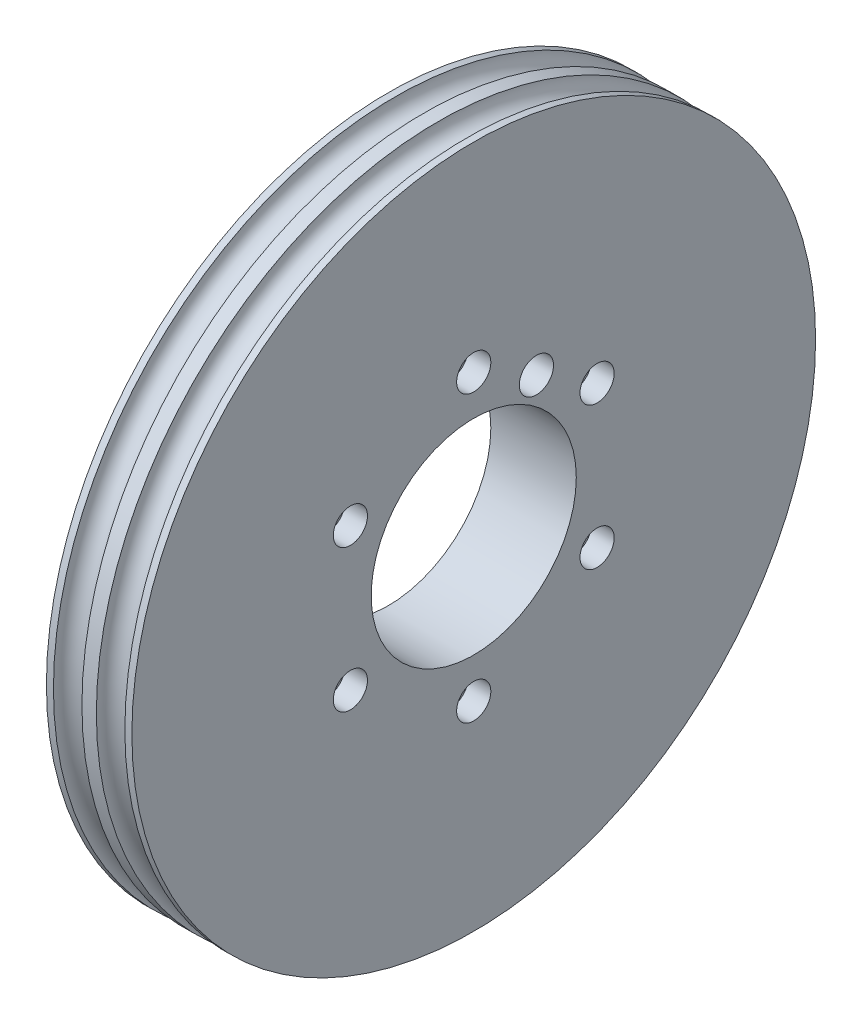
ISO-10303-21;
HEADER;
FILE_DESCRIPTION(('STEP AP214'),'2;1');
FILE_NAME('part.step','',(''),(''),'','','');
FILE_SCHEMA(('AUTOMOTIVE_DESIGN { 1 0 10303 214 1 1 1 1 }'));
ENDSEC;
DATA;
#1=APPLICATION_CONTEXT('core data for automotive mechanical design processes');
#2=APPLICATION_PROTOCOL_DEFINITION('international standard','automotive_design',2000,#1);
#3=PRODUCT_CONTEXT('',#1,'mechanical');
#4=PRODUCT('Part','Part','',(#3));
#5=PRODUCT_RELATED_PRODUCT_CATEGORY('part','',(#4));
#6=PRODUCT_DEFINITION_FORMATION('','',#4);
#7=PRODUCT_DEFINITION_CONTEXT('part definition',#1,'design');
#8=PRODUCT_DEFINITION('design','',#6,#7);
#9=PRODUCT_DEFINITION_SHAPE('','',#8);
#10=(LENGTH_UNIT() NAMED_UNIT(*) SI_UNIT(.MILLI.,.METRE.));
#11=(NAMED_UNIT(*) PLANE_ANGLE_UNIT() SI_UNIT($,.RADIAN.));
#12=(NAMED_UNIT(*) SI_UNIT($,.STERADIAN.) SOLID_ANGLE_UNIT());
#13=UNCERTAINTY_MEASURE_WITH_UNIT(LENGTH_MEASURE(1.E-05),#10,'distance_accuracy_value','');
#14=(GEOMETRIC_REPRESENTATION_CONTEXT(3) GLOBAL_UNCERTAINTY_ASSIGNED_CONTEXT((#13)) GLOBAL_UNIT_ASSIGNED_CONTEXT((#10,
#11,#12)) REPRESENTATION_CONTEXT('',''));
#15=CARTESIAN_POINT('',(0.,0.,0.));
#16=DIRECTION('',(0.,0.,1.));
#17=DIRECTION('',(1.,0.,0.));
#18=AXIS2_PLACEMENT_3D('',#15,#16,#17);
#19=CARTESIAN_POINT('',(-7.501,12.5000000000008,-21.6506350946114));
#20=DIRECTION('',(1.,0.,0.));
#21=DIRECTION('',(0.,0.,-1.));
#22=AXIS2_PLACEMENT_3D('',#19,#20,#21);
#23=CYLINDRICAL_SURFACE('',#22,2.0000000000011);
#24=CARTESIAN_POINT('',(-7.5,12.5000000000008,-21.6506350946114));
#25=DIRECTION('',(1.,0.,0.));
#26=DIRECTION('',(0.,0.,-1.));
#27=AXIS2_PLACEMENT_3D('',#24,#25,#26);
#28=CIRCLE('',#27,2.0000000000011);
#29=CARTESIAN_POINT('',(-7.5,12.5000000000008,-23.6506350946125));
#30=VERTEX_POINT('',#29);
#31=EDGE_CURVE('E160',#30,#30,#28,.F.);
#32=ORIENTED_EDGE('',*,*,#31,.T.);
#33=EDGE_LOOP('',(#32));
#34=FACE_BOUND('',#33,.T.);
#35=CARTESIAN_POINT('',(3.5,12.5000000000008,-21.6506350946114));
#36=DIRECTION('',(1.,0.,0.));
#37=DIRECTION('',(0.,0.,-1.));
#38=AXIS2_PLACEMENT_3D('',#35,#36,#37);
#39=CIRCLE('',#38,2.0000000000011);
#40=CARTESIAN_POINT('',(3.5,12.5000000000008,-23.6506350946125));
#41=VERTEX_POINT('',#40);
#42=EDGE_CURVE('E38',#41,#41,#39,.F.);
#43=ORIENTED_EDGE('',*,*,#42,.F.);
#44=EDGE_LOOP('',(#43));
#45=FACE_BOUND('',#44,.T.);
#46=ADVANCED_FACE('F34',(#34,#45),#23,.F.);
#47=CARTESIAN_POINT('',(-7.501,-12.4999999999992,-21.6506350946123));
#48=DIRECTION('',(1.,0.,0.));
#49=DIRECTION('',(0.,0.,-1.));
#50=AXIS2_PLACEMENT_3D('',#47,#48,#49);
#51=CYLINDRICAL_SURFACE('',#50,2.0000000000011);
#52=CARTESIAN_POINT('',(-7.5,-12.4999999999992,-21.6506350946123));
#53=DIRECTION('',(1.,0.,0.));
#54=DIRECTION('',(0.,0.,-1.));
#55=AXIS2_PLACEMENT_3D('',#52,#53,#54);
#56=CIRCLE('',#55,2.0000000000011);
#57=CARTESIAN_POINT('',(-7.5,-12.4999999999992,-23.6506350946134));
#58=VERTEX_POINT('',#57);
#59=EDGE_CURVE('E164',#58,#58,#56,.F.);
#60=ORIENTED_EDGE('',*,*,#59,.T.);
#61=EDGE_LOOP('',(#60));
#62=FACE_BOUND('',#61,.T.);
#63=CARTESIAN_POINT('',(3.5,-12.4999999999992,-21.6506350946123));
#64=DIRECTION('',(1.,0.,0.));
#65=DIRECTION('',(0.,0.,-1.));
#66=AXIS2_PLACEMENT_3D('',#63,#64,#65);
#67=CIRCLE('',#66,2.0000000000011);
#68=CARTESIAN_POINT('',(3.5,-12.4999999999992,-23.6506350946134));
#69=VERTEX_POINT('',#68);
#70=EDGE_CURVE('E89',#69,#69,#67,.F.);
#71=ORIENTED_EDGE('',*,*,#70,.F.);
#72=EDGE_LOOP('',(#71));
#73=FACE_BOUND('',#72,.T.);
#74=ADVANCED_FACE('F103',(#62,#73),#51,.F.);
#75=CARTESIAN_POINT('',(-7.501,-25.,-1.78591403627869E-12));
#76=DIRECTION('',(1.,0.,0.));
#77=DIRECTION('',(0.,0.,-1.));
#78=AXIS2_PLACEMENT_3D('',#75,#76,#77);
#79=CYLINDRICAL_SURFACE('',#78,2.00000000000109);
#80=CARTESIAN_POINT('',(-7.5,-25.,-1.78591403627869E-12));
#81=DIRECTION('',(1.,0.,0.));
#82=DIRECTION('',(0.,0.,-1.));
#83=AXIS2_PLACEMENT_3D('',#80,#81,#82);
#84=CIRCLE('',#83,2.00000000000109);
#85=CARTESIAN_POINT('',(-7.5,-25.,-2.00000000000288));
#86=VERTEX_POINT('',#85);
#87=EDGE_CURVE('E168',#86,#86,#84,.F.);
#88=ORIENTED_EDGE('',*,*,#87,.T.);
#89=EDGE_LOOP('',(#88));
#90=FACE_BOUND('',#89,.T.);
#91=CARTESIAN_POINT('',(3.5,-25.,-1.78591403627869E-12));
#92=DIRECTION('',(1.,0.,0.));
#93=DIRECTION('',(0.,0.,-1.));
#94=AXIS2_PLACEMENT_3D('',#91,#92,#93);
#95=CIRCLE('',#94,2.00000000000109);
#96=CARTESIAN_POINT('',(3.5,-25.,-2.00000000000288));
#97=VERTEX_POINT('',#96);
#98=EDGE_CURVE('E86',#97,#97,#95,.F.);
#99=ORIENTED_EDGE('',*,*,#98,.F.);
#100=EDGE_LOOP('',(#99));
#101=FACE_BOUND('',#100,.T.);
#102=ADVANCED_FACE('F109',(#90,#101),#79,.F.);
#103=CARTESIAN_POINT('',(-7.501,-12.5000000000008,21.6506350946096));
#104=DIRECTION('',(1.,0.,0.));
#105=DIRECTION('',(0.,0.,-1.));
#106=AXIS2_PLACEMENT_3D('',#103,#104,#105);
#107=CYLINDRICAL_SURFACE('',#106,2.0000000000011);
#108=CARTESIAN_POINT('',(-7.5,-12.5000000000008,21.6506350946096));
#109=DIRECTION('',(1.,0.,0.));
#110=DIRECTION('',(0.,0.,-1.));
#111=AXIS2_PLACEMENT_3D('',#108,#109,#110);
#112=CIRCLE('',#111,2.0000000000011);
#113=CARTESIAN_POINT('',(-7.5,-12.5000000000008,19.6506350946085));
#114=VERTEX_POINT('',#113);
#115=EDGE_CURVE('E172',#114,#114,#112,.F.);
#116=ORIENTED_EDGE('',*,*,#115,.T.);
#117=EDGE_LOOP('',(#116));
#118=FACE_BOUND('',#117,.T.);
#119=CARTESIAN_POINT('',(3.5,-12.5000000000008,21.6506350946096));
#120=DIRECTION('',(1.,0.,0.));
#121=DIRECTION('',(0.,0.,-1.));
#122=AXIS2_PLACEMENT_3D('',#119,#120,#121);
#123=CIRCLE('',#122,2.0000000000011);
#124=CARTESIAN_POINT('',(3.5,-12.5000000000008,19.6506350946085));
#125=VERTEX_POINT('',#124);
#126=EDGE_CURVE('E82',#125,#125,#123,.F.);
#127=ORIENTED_EDGE('',*,*,#126,.F.);
#128=EDGE_LOOP('',(#127));
#129=FACE_BOUND('',#128,.T.);
#130=ADVANCED_FACE('F119',(#118,#129),#107,.F.);
#131=CARTESIAN_POINT('',(-7.501,12.4999999999992,21.6506350946105));
#132=DIRECTION('',(1.,0.,0.));
#133=DIRECTION('',(0.,0.,-1.));
#134=AXIS2_PLACEMENT_3D('',#131,#132,#133);
#135=CYLINDRICAL_SURFACE('',#134,2.0000000000011);
#136=CARTESIAN_POINT('',(-7.5,12.4999999999992,21.6506350946105));
#137=DIRECTION('',(1.,0.,0.));
#138=DIRECTION('',(0.,0.,-1.));
#139=AXIS2_PLACEMENT_3D('',#136,#137,#138);
#140=CIRCLE('',#139,2.0000000000011);
#141=CARTESIAN_POINT('',(-7.5,12.4999999999992,19.6506350946094));
#142=VERTEX_POINT('',#141);
#143=EDGE_CURVE('E176',#142,#142,#140,.F.);
#144=ORIENTED_EDGE('',*,*,#143,.T.);
#145=EDGE_LOOP('',(#144));
#146=FACE_BOUND('',#145,.T.);
#147=CARTESIAN_POINT('',(3.5,12.4999999999992,21.6506350946105));
#148=DIRECTION('',(1.,0.,0.));
#149=DIRECTION('',(0.,0.,-1.));
#150=AXIS2_PLACEMENT_3D('',#147,#148,#149);
#151=CIRCLE('',#150,2.0000000000011);
#152=CARTESIAN_POINT('',(3.5,12.4999999999992,19.6506350946094));
#153=VERTEX_POINT('',#152);
#154=EDGE_CURVE('E77',#153,#153,#151,.F.);
#155=ORIENTED_EDGE('',*,*,#154,.F.);
#156=EDGE_LOOP('',(#155));
#157=FACE_BOUND('',#156,.T.);
#158=ADVANCED_FACE('F114',(#146,#157),#135,.F.);
#159=CARTESIAN_POINT('',(-7.501,25.,0.));
#160=DIRECTION('',(1.,0.,0.));
#161=DIRECTION('',(0.,0.,-1.));
#162=AXIS2_PLACEMENT_3D('',#159,#160,#161);
#163=CYLINDRICAL_SURFACE('',#162,2.0000000000011);
#164=CARTESIAN_POINT('',(-7.5,25.,0.));
#165=DIRECTION('',(1.,0.,0.));
#166=DIRECTION('',(0.,0.,-1.));
#167=AXIS2_PLACEMENT_3D('',#164,#165,#166);
#168=CIRCLE('',#167,2.0000000000011);
#169=CARTESIAN_POINT('',(-7.5,25.,-2.0000000000011));
#170=VERTEX_POINT('',#169);
#171=EDGE_CURVE('E180',#170,#170,#168,.F.);
#172=ORIENTED_EDGE('',*,*,#171,.T.);
#173=EDGE_LOOP('',(#172));
#174=FACE_BOUND('',#173,.T.);
#175=CARTESIAN_POINT('',(3.5,25.,0.));
#176=DIRECTION('',(1.,0.,0.));
#177=DIRECTION('',(0.,0.,-1.));
#178=AXIS2_PLACEMENT_3D('',#175,#176,#177);
#179=CIRCLE('',#178,2.0000000000011);
#180=CARTESIAN_POINT('',(3.5,25.,-2.0000000000011));
#181=VERTEX_POINT('',#180);
#182=EDGE_CURVE('E73',#181,#181,#179,.F.);
#183=ORIENTED_EDGE('',*,*,#182,.F.);
#184=EDGE_LOOP('',(#183));
#185=FACE_BOUND('',#184,.T.);
#186=ADVANCED_FACE('F149',(#174,#185),#163,.F.);
#187=CARTESIAN_POINT('',(7.5,0.,0.));
#188=DIRECTION('',(-1.,0.,0.));
#189=DIRECTION('',(0.,0.,1.));
#190=AXIS2_PLACEMENT_3D('',#187,#188,#189);
#191=CYLINDRICAL_SURFACE('',#190,60.);
#192=CARTESIAN_POINT('',(6.26684829146023,0.,0.));
#193=DIRECTION('',(-1.,0.,0.));
#194=DIRECTION('',(0.,0.,1.));
#195=AXIS2_PLACEMENT_3D('',#192,#193,#194);
#196=CIRCLE('',#195,60.);
#197=CARTESIAN_POINT('',(6.26684829146023,0.,60.));
#198=VERTEX_POINT('',#197);
#199=EDGE_CURVE('E68',#198,#198,#196,.F.);
#200=ORIENTED_EDGE('',*,*,#199,.T.);
#201=EDGE_LOOP('',(#200));
#202=FACE_BOUND('',#201,.T.);
#203=CARTESIAN_POINT('',(7.5,0.,0.));
#204=DIRECTION('',(1.,0.,0.));
#205=DIRECTION('',(0.,0.,-1.));
#206=AXIS2_PLACEMENT_3D('',#203,#204,#205);
#207=CIRCLE('',#206,60.);
#208=CARTESIAN_POINT('',(7.5,0.,-60.));
#209=VERTEX_POINT('',#208);
#210=EDGE_CURVE('E10',#209,#209,#207,.T.);
#211=ORIENTED_EDGE('',*,*,#210,.F.);
#212=EDGE_LOOP('',(#211));
#213=FACE_BOUND('',#212,.T.);
#214=ADVANCED_FACE('F140',(#202,#213),#191,.T.);
#215=CARTESIAN_POINT('',(-7.5,0.,0.));
#216=DIRECTION('',(1.,0.,0.));
#217=DIRECTION('',(0.,0.,-1.));
#218=AXIS2_PLACEMENT_3D('',#215,#216,#217);
#219=PLANE('',#218);
#220=CARTESIAN_POINT('',(-7.5,19.0525588832576,-11.));
#221=DIRECTION('',(-1.,0.,0.));
#222=DIRECTION('',(0.,0.,1.));
#223=AXIS2_PLACEMENT_3D('',#220,#221,#222);
#224=CIRCLE('',#223,3.);
#225=CARTESIAN_POINT('',(-7.5,19.0525588832576,-8.00000000000002));
#226=VERTEX_POINT('',#225);
#227=EDGE_CURVE('E154',#226,#226,#224,.T.);
#228=ORIENTED_EDGE('',*,*,#227,.F.);
#229=EDGE_LOOP('',(#228));
#230=FACE_BOUND('',#229,.T.);
#231=CARTESIAN_POINT('',(-7.5,0.,0.));
#232=DIRECTION('',(1.,0.,0.));
#233=DIRECTION('',(0.,0.,-1.));
#234=AXIS2_PLACEMENT_3D('',#231,#232,#233);
#235=CIRCLE('',#234,18.);
#236=CARTESIAN_POINT('',(-7.5,0.,-18.));
#237=VERTEX_POINT('',#236);
#238=EDGE_CURVE('E53',#237,#237,#235,.T.);
#239=ORIENTED_EDGE('',*,*,#238,.T.);
#240=EDGE_LOOP('',(#239));
#241=FACE_BOUND('',#240,.T.);
#242=ORIENTED_EDGE('',*,*,#31,.F.);
#243=EDGE_LOOP('',(#242));
#244=FACE_BOUND('',#243,.T.);
#245=ORIENTED_EDGE('',*,*,#59,.F.);
#246=EDGE_LOOP('',(#245));
#247=FACE_BOUND('',#246,.T.);
#248=ORIENTED_EDGE('',*,*,#87,.F.);
#249=EDGE_LOOP('',(#248));
#250=FACE_BOUND('',#249,.T.);
#251=ORIENTED_EDGE('',*,*,#115,.F.);
#252=EDGE_LOOP('',(#251));
#253=FACE_BOUND('',#252,.T.);
#254=ORIENTED_EDGE('',*,*,#143,.F.);
#255=EDGE_LOOP('',(#254));
#256=FACE_BOUND('',#255,.T.);
#257=ORIENTED_EDGE('',*,*,#171,.F.);
#258=EDGE_LOOP('',(#257));
#259=FACE_BOUND('',#258,.T.);
#260=CARTESIAN_POINT('',(-7.5,0.,0.));
#261=DIRECTION('',(-1.,0.,0.));
#262=DIRECTION('',(0.,0.,1.));
#263=AXIS2_PLACEMENT_3D('',#260,#261,#262);
#264=CIRCLE('',#263,30.);
#265=CARTESIAN_POINT('',(-7.5,0.,30.));
#266=VERTEX_POINT('',#265);
#267=EDGE_CURVE('E183',#266,#266,#264,.T.);
#268=ORIENTED_EDGE('',*,*,#267,.T.);
#269=EDGE_LOOP('',(#268));
#270=FACE_BOUND('',#269,.T.);
#271=ADVANCED_FACE('F132',(#230,#241,#244,#247,#250,#253,#256,#259,#270),#219,.F.);
#272=CARTESIAN_POINT('',(7.5,0.,0.));
#273=DIRECTION('',(1.,0.,0.));
#274=DIRECTION('',(0.,0.,-1.));
#275=AXIS2_PLACEMENT_3D('',#272,#273,#274);
#276=PLANE('',#275);
#277=CARTESIAN_POINT('',(7.5,19.0525588832576,-11.));
#278=DIRECTION('',(1.,0.,0.));
#279=DIRECTION('',(0.,0.,-1.));
#280=AXIS2_PLACEMENT_3D('',#277,#278,#279);
#281=CIRCLE('',#280,3.);
#282=CARTESIAN_POINT('',(7.5,19.0525588832576,-14.));
#283=VERTEX_POINT('',#282);
#284=EDGE_CURVE('E275',#283,#283,#281,.F.);
#285=ORIENTED_EDGE('',*,*,#284,.T.);
#286=EDGE_LOOP('',(#285));
#287=FACE_BOUND('',#286,.T.);
#288=CARTESIAN_POINT('',(7.5,25.,0.));
#289=DIRECTION('',(1.,0.,0.));
#290=DIRECTION('',(0.,0.,-1.));
#291=AXIS2_PLACEMENT_3D('',#288,#289,#290);
#292=CIRCLE('',#291,3.);
#293=CARTESIAN_POINT('',(7.5,25.,-3.));
#294=VERTEX_POINT('',#293);
#295=EDGE_CURVE('E261',#294,#294,#292,.T.);
#296=ORIENTED_EDGE('',*,*,#295,.F.);
#297=EDGE_LOOP('',(#296));
#298=FACE_BOUND('',#297,.T.);
#299=CARTESIAN_POINT('',(7.5,12.4999999999988,21.6506350946103));
#300=DIRECTION('',(1.,0.,0.));
#301=DIRECTION('',(0.,0.,-1.));
#302=AXIS2_PLACEMENT_3D('',#299,#300,#301);
#303=CIRCLE('',#302,3.00000000000133);
#304=CARTESIAN_POINT('',(7.5,12.4999999999988,18.6506350946089));
#305=VERTEX_POINT('',#304);
#306=EDGE_CURVE('E262',#305,#305,#303,.T.);
#307=ORIENTED_EDGE('',*,*,#306,.F.);
#308=EDGE_LOOP('',(#307));
#309=FACE_BOUND('',#308,.T.);
#310=CARTESIAN_POINT('',(7.5,-12.5000000000012,21.6506350946088));
#311=DIRECTION('',(1.,0.,0.));
#312=DIRECTION('',(0.,0.,-1.));
#313=AXIS2_PLACEMENT_3D('',#310,#311,#312);
#314=CIRCLE('',#313,3.00000000000263);
#315=CARTESIAN_POINT('',(7.5,-12.5000000000012,18.6506350946062));
#316=VERTEX_POINT('',#315);
#317=EDGE_CURVE('E228',#316,#316,#314,.T.);
#318=ORIENTED_EDGE('',*,*,#317,.F.);
#319=EDGE_LOOP('',(#318));
#320=FACE_BOUND('',#319,.T.);
#321=CARTESIAN_POINT('',(7.5,-25.,-2.83604770904466E-12));
#322=DIRECTION('',(1.,0.,0.));
#323=DIRECTION('',(0.,0.,-1.));
#324=AXIS2_PLACEMENT_3D('',#321,#322,#323);
#325=CIRCLE('',#324,3.00000000000288);
#326=CARTESIAN_POINT('',(7.5,-25.,-3.00000000000571));
#327=VERTEX_POINT('',#326);
#328=EDGE_CURVE('E237',#327,#327,#325,.T.);
#329=ORIENTED_EDGE('',*,*,#328,.F.);
#330=EDGE_LOOP('',(#329));
#331=FACE_BOUND('',#330,.T.);
#332=CARTESIAN_POINT('',(7.5,-12.4999999999988,-21.6506350946131));
#333=DIRECTION('',(1.,0.,0.));
#334=DIRECTION('',(0.,0.,-1.));
#335=AXIS2_PLACEMENT_3D('',#332,#333,#334);
#336=CIRCLE('',#335,3.00000000000179);
#337=CARTESIAN_POINT('',(7.5,-12.4999999999988,-24.6506350946149));
#338=VERTEX_POINT('',#337);
#339=EDGE_CURVE('E245',#338,#338,#336,.T.);
#340=ORIENTED_EDGE('',*,*,#339,.F.);
#341=EDGE_LOOP('',(#340));
#342=FACE_BOUND('',#341,.T.);
#343=CARTESIAN_POINT('',(7.5,12.5000000000012,-21.6506350946117));
#344=DIRECTION('',(1.,0.,0.));
#345=DIRECTION('',(0.,0.,-1.));
#346=AXIS2_PLACEMENT_3D('',#343,#344,#345);
#347=CIRCLE('',#346,3.00000000000038);
#348=CARTESIAN_POINT('',(7.5,12.5000000000012,-24.6506350946121));
#349=VERTEX_POINT('',#348);
#350=EDGE_CURVE('E253',#349,#349,#347,.T.);
#351=ORIENTED_EDGE('',*,*,#350,.F.);
#352=EDGE_LOOP('',(#351));
#353=FACE_BOUND('',#352,.T.);
#354=ORIENTED_EDGE('',*,*,#210,.T.);
#355=EDGE_LOOP('',(#354));
#356=FACE_BOUND('',#355,.T.);
#357=CARTESIAN_POINT('',(7.5,0.,0.));
#358=DIRECTION('',(1.,0.,0.));
#359=DIRECTION('',(0.,0.,-1.));
#360=AXIS2_PLACEMENT_3D('',#357,#358,#359);
#361=CIRCLE('',#360,18.);
#362=CARTESIAN_POINT('',(7.5,0.,-18.));
#363=VERTEX_POINT('',#362);
#364=EDGE_CURVE('E50',#363,#363,#361,.T.);
#365=ORIENTED_EDGE('',*,*,#364,.F.);
#366=EDGE_LOOP('',(#365));
#367=FACE_BOUND('',#366,.T.);
#368=ADVANCED_FACE('F129',(#287,#298,#309,#320,#331,#342,#353,#356,#367),#276,.T.);
#369=CARTESIAN_POINT('',(-7.5,0.,0.));
#370=DIRECTION('',(-1.,0.,0.));
#371=DIRECTION('',(0.,0.,1.));
#372=AXIS2_PLACEMENT_3D('',#369,#370,#371);
#373=CIRCLE('',#372,33.);
#374=CARTESIAN_POINT('',(-7.5,0.,33.));
#375=VERTEX_POINT('',#374);
#376=EDGE_CURVE('E72',#375,#375,#373,.T.);
#377=ORIENTED_EDGE('',*,*,#376,.F.);
#378=EDGE_LOOP('',(#377));
#379=FACE_BOUND('',#378,.T.);
#380=CARTESIAN_POINT('',(-7.5,0.,0.));
#381=DIRECTION('',(1.,0.,0.));
#382=DIRECTION('',(0.,0.,-1.));
#383=AXIS2_PLACEMENT_3D('',#380,#381,#382);
#384=CIRCLE('',#383,60.);
#385=CARTESIAN_POINT('',(-7.5,0.,-60.));
#386=VERTEX_POINT('',#385);
#387=EDGE_CURVE('E43',#386,#386,#384,.T.);
#388=ORIENTED_EDGE('',*,*,#387,.F.);
#389=EDGE_LOOP('',(#388));
#390=FACE_BOUND('',#389,.T.);
#391=ADVANCED_FACE('F131',(#379,#390),#219,.F.);
#392=CARTESIAN_POINT('',(-6.26684829146023,0.,0.));
#393=DIRECTION('',(1.,0.,0.));
#394=DIRECTION('',(0.,0.,-1.));
#395=AXIS2_PLACEMENT_3D('',#392,#393,#394);
#396=CIRCLE('',#395,60.);
#397=CARTESIAN_POINT('',(-6.26684829146023,0.,-60.));
#398=VERTEX_POINT('',#397);
#399=EDGE_CURVE('E56',#398,#398,#396,.F.);
#400=ORIENTED_EDGE('',*,*,#399,.T.);
#401=EDGE_LOOP('',(#400));
#402=FACE_BOUND('',#401,.T.);
#403=ORIENTED_EDGE('',*,*,#387,.T.);
#404=EDGE_LOOP('',(#403));
#405=FACE_BOUND('',#404,.T.);
#406=ADVANCED_FACE('F36',(#402,#405),#191,.T.);
#407=CARTESIAN_POINT('',(7.5,0.,0.));
#408=DIRECTION('',(-1.,0.,0.));
#409=DIRECTION('',(0.,0.,1.));
#410=AXIS2_PLACEMENT_3D('',#407,#408,#409);
#411=CYLINDRICAL_SURFACE('',#410,18.);
#412=ORIENTED_EDGE('',*,*,#364,.T.);
#413=EDGE_LOOP('',(#412));
#414=FACE_BOUND('',#413,.T.);
#415=ORIENTED_EDGE('',*,*,#238,.F.);
#416=EDGE_LOOP('',(#415));
#417=FACE_BOUND('',#416,.T.);
#418=ADVANCED_FACE('F124',(#414,#417),#411,.F.);
#419=CARTESIAN_POINT('',(-4.5,0.,0.));
#420=DIRECTION('',(-1.,0.,0.));
#421=DIRECTION('',(0.,0.,1.));
#422=AXIS2_PLACEMENT_3D('',#419,#420,#421);
#423=CYLINDRICAL_SURFACE('',#422,33.);
#424=CARTESIAN_POINT('',(-4.5,0.,0.));
#425=DIRECTION('',(-1.,0.,0.));
#426=DIRECTION('',(0.,0.,1.));
#427=AXIS2_PLACEMENT_3D('',#424,#425,#426);
#428=CIRCLE('',#427,33.);
#429=CARTESIAN_POINT('',(-4.5,0.,33.));
#430=VERTEX_POINT('',#429);
#431=EDGE_CURVE('E186',#430,#430,#428,.T.);
#432=ORIENTED_EDGE('',*,*,#431,.F.);
#433=EDGE_LOOP('',(#432));
#434=FACE_BOUND('',#433,.T.);
#435=ORIENTED_EDGE('',*,*,#376,.T.);
#436=EDGE_LOOP('',(#435));
#437=FACE_BOUND('',#436,.T.);
#438=ADVANCED_FACE('F127',(#434,#437),#423,.F.);
#439=CARTESIAN_POINT('',(-4.5,0.,0.));
#440=DIRECTION('',(-1.,0.,0.));
#441=DIRECTION('',(0.,0.,1.));
#442=AXIS2_PLACEMENT_3D('',#439,#440,#441);
#443=CYLINDRICAL_SURFACE('',#442,30.);
#444=CARTESIAN_POINT('',(-4.5,0.,0.));
#445=DIRECTION('',(-1.,0.,0.));
#446=DIRECTION('',(0.,0.,1.));
#447=AXIS2_PLACEMENT_3D('',#444,#445,#446);
#448=CIRCLE('',#447,30.);
#449=CARTESIAN_POINT('',(-4.5,0.,30.));
#450=VERTEX_POINT('',#449);
#451=EDGE_CURVE('E192',#450,#450,#448,.T.);
#452=ORIENTED_EDGE('',*,*,#451,.T.);
#453=EDGE_LOOP('',(#452));
#454=FACE_BOUND('',#453,.T.);
#455=ORIENTED_EDGE('',*,*,#267,.F.);
#456=EDGE_LOOP('',(#455));
#457=FACE_BOUND('',#456,.T.);
#458=ADVANCED_FACE('F348',(#454,#457),#443,.T.);
#459=CARTESIAN_POINT('',(-4.5,0.,0.));
#460=DIRECTION('',(-1.,0.,0.));
#461=DIRECTION('',(0.,0.,1.));
#462=AXIS2_PLACEMENT_3D('',#459,#460,#461);
#463=PLANE('',#462);
#464=ORIENTED_EDGE('',*,*,#431,.T.);
#465=EDGE_LOOP('',(#464));
#466=FACE_BOUND('',#465,.T.);
#467=ORIENTED_EDGE('',*,*,#451,.F.);
#468=EDGE_LOOP('',(#467));
#469=FACE_BOUND('',#468,.T.);
#470=ADVANCED_FACE('F344',(#466,#469),#463,.T.);
#471=CARTESIAN_POINT('',(-3.76688657748616,0.,0.));
#472=DIRECTION('',(1.,0.,0.));
#473=DIRECTION('',(0.,0.,-1.));
#474=AXIS2_PLACEMENT_3D('',#471,#472,#473);
#475=TOROIDAL_SURFACE('',#474,60.0138357747824,2.5);
#476=ORIENTED_EDGE('',*,*,#399,.F.);
#477=EDGE_LOOP('',(#476));
#478=FACE_BOUND('',#477,.T.);
#479=CARTESIAN_POINT('',(-1.26692486351209,0.,0.));
#480=DIRECTION('',(-1.,0.,0.));
#481=DIRECTION('',(0.,0.,1.));
#482=AXIS2_PLACEMENT_3D('',#479,#480,#481);
#483=CIRCLE('',#482,60.);
#484=CARTESIAN_POINT('',(-1.26692486351209,0.,60.));
#485=VERTEX_POINT('',#484);
#486=EDGE_CURVE('E60',#485,#485,#483,.F.);
#487=ORIENTED_EDGE('',*,*,#486,.F.);
#488=EDGE_LOOP('',(#487));
#489=FACE_BOUND('',#488,.T.);
#490=ADVANCED_FACE('F341',(#478,#489),#475,.F.);
#491=CARTESIAN_POINT('',(1.26692486351209,0.,0.));
#492=DIRECTION('',(1.,0.,0.));
#493=DIRECTION('',(0.,0.,-1.));
#494=AXIS2_PLACEMENT_3D('',#491,#492,#493);
#495=CIRCLE('',#494,60.);
#496=CARTESIAN_POINT('',(1.26692486351209,0.,-60.));
#497=VERTEX_POINT('',#496);
#498=EDGE_CURVE('E64',#497,#497,#495,.F.);
#499=ORIENTED_EDGE('',*,*,#498,.T.);
#500=EDGE_LOOP('',(#499));
#501=FACE_BOUND('',#500,.T.);
#502=ORIENTED_EDGE('',*,*,#486,.T.);
#503=EDGE_LOOP('',(#502));
#504=FACE_BOUND('',#503,.T.);
#505=ADVANCED_FACE('F141',(#501,#504),#191,.T.);
#506=CARTESIAN_POINT('',(3.76688657748616,0.,0.));
#507=DIRECTION('',(1.,0.,0.));
#508=DIRECTION('',(0.,0.,-1.));
#509=AXIS2_PLACEMENT_3D('',#506,#507,#508);
#510=TOROIDAL_SURFACE('',#509,60.0138357747824,2.5);
#511=ORIENTED_EDGE('',*,*,#498,.F.);
#512=EDGE_LOOP('',(#511));
#513=FACE_BOUND('',#512,.T.);
#514=ORIENTED_EDGE('',*,*,#199,.F.);
#515=EDGE_LOOP('',(#514));
#516=FACE_BOUND('',#515,.T.);
#517=ADVANCED_FACE('F298',(#513,#516),#510,.F.);
#518=CARTESIAN_POINT('',(3.5,25.,0.));
#519=DIRECTION('',(1.,0.,0.));
#520=DIRECTION('',(0.,0.,-1.));
#521=AXIS2_PLACEMENT_3D('',#518,#519,#520);
#522=PLANE('',#521);
#523=CARTESIAN_POINT('',(3.5,25.,0.));
#524=DIRECTION('',(1.,0.,0.));
#525=DIRECTION('',(0.,0.,-1.));
#526=AXIS2_PLACEMENT_3D('',#523,#524,#525);
#527=CIRCLE('',#526,3.);
#528=CARTESIAN_POINT('',(3.5,25.,-3.));
#529=VERTEX_POINT('',#528);
#530=EDGE_CURVE('E78',#529,#529,#527,.T.);
#531=ORIENTED_EDGE('',*,*,#530,.T.);
#532=EDGE_LOOP('',(#531));
#533=FACE_BOUND('',#532,.T.);
#534=ORIENTED_EDGE('',*,*,#182,.T.);
#535=EDGE_LOOP('',(#534));
#536=FACE_BOUND('',#535,.T.);
#537=ADVANCED_FACE('F294',(#533,#536),#522,.T.);
#538=CARTESIAN_POINT('',(3.5,25.,0.));
#539=DIRECTION('',(1.,0.,0.));
#540=DIRECTION('',(0.,0.,-1.));
#541=AXIS2_PLACEMENT_3D('',#538,#539,#540);
#542=CYLINDRICAL_SURFACE('',#541,3.);
#543=ORIENTED_EDGE('',*,*,#530,.F.);
#544=EDGE_LOOP('',(#543));
#545=FACE_BOUND('',#544,.T.);
#546=ORIENTED_EDGE('',*,*,#295,.T.);
#547=EDGE_LOOP('',(#546));
#548=FACE_BOUND('',#547,.T.);
#549=ADVANCED_FACE('F297',(#545,#548),#542,.F.);
#550=CARTESIAN_POINT('',(3.5,12.4999999999988,21.6506350946103));
#551=DIRECTION('',(1.,0.,0.));
#552=DIRECTION('',(0.,0.,-1.));
#553=AXIS2_PLACEMENT_3D('',#550,#551,#552);
#554=PLANE('',#553);
#555=CARTESIAN_POINT('',(3.5,12.4999999999988,21.6506350946103));
#556=DIRECTION('',(1.,0.,0.));
#557=DIRECTION('',(0.,0.,-1.));
#558=AXIS2_PLACEMENT_3D('',#555,#556,#557);
#559=CIRCLE('',#558,3.00000000000133);
#560=CARTESIAN_POINT('',(3.5,12.4999999999988,18.6506350946089));
#561=VERTEX_POINT('',#560);
#562=EDGE_CURVE('E233',#561,#561,#559,.T.);
#563=ORIENTED_EDGE('',*,*,#562,.T.);
#564=EDGE_LOOP('',(#563));
#565=FACE_BOUND('',#564,.T.);
#566=ORIENTED_EDGE('',*,*,#154,.T.);
#567=EDGE_LOOP('',(#566));
#568=FACE_BOUND('',#567,.T.);
#569=ADVANCED_FACE('F302',(#565,#568),#554,.T.);
#570=CARTESIAN_POINT('',(3.5,12.4999999999988,21.6506350946103));
#571=DIRECTION('',(1.,0.,0.));
#572=DIRECTION('',(0.,0.,-1.));
#573=AXIS2_PLACEMENT_3D('',#570,#571,#572);
#574=CYLINDRICAL_SURFACE('',#573,3.00000000000133);
#575=ORIENTED_EDGE('',*,*,#562,.F.);
#576=EDGE_LOOP('',(#575));
#577=FACE_BOUND('',#576,.T.);
#578=ORIENTED_EDGE('',*,*,#306,.T.);
#579=EDGE_LOOP('',(#578));
#580=FACE_BOUND('',#579,.T.);
#581=ADVANCED_FACE('F306',(#577,#580),#574,.F.);
#582=CARTESIAN_POINT('',(3.5,-12.5000000000012,21.6506350946088));
#583=DIRECTION('',(1.,0.,0.));
#584=DIRECTION('',(0.,0.,-1.));
#585=AXIS2_PLACEMENT_3D('',#582,#583,#584);
#586=PLANE('',#585);
#587=CARTESIAN_POINT('',(3.5,-12.5000000000012,21.6506350946088));
#588=DIRECTION('',(1.,0.,0.));
#589=DIRECTION('',(0.,0.,-1.));
#590=AXIS2_PLACEMENT_3D('',#587,#588,#589);
#591=CIRCLE('',#590,3.00000000000263);
#592=CARTESIAN_POINT('',(3.5,-12.5000000000012,18.6506350946062));
#593=VERTEX_POINT('',#592);
#594=EDGE_CURVE('E232',#593,#593,#591,.T.);
#595=ORIENTED_EDGE('',*,*,#594,.T.);
#596=EDGE_LOOP('',(#595));
#597=FACE_BOUND('',#596,.T.);
#598=ORIENTED_EDGE('',*,*,#126,.T.);
#599=EDGE_LOOP('',(#598));
#600=FACE_BOUND('',#599,.T.);
#601=ADVANCED_FACE('F310',(#597,#600),#586,.T.);
#602=CARTESIAN_POINT('',(3.5,-12.5000000000012,21.6506350946088));
#603=DIRECTION('',(1.,0.,0.));
#604=DIRECTION('',(0.,0.,-1.));
#605=AXIS2_PLACEMENT_3D('',#602,#603,#604);
#606=CYLINDRICAL_SURFACE('',#605,3.00000000000263);
#607=ORIENTED_EDGE('',*,*,#594,.F.);
#608=EDGE_LOOP('',(#607));
#609=FACE_BOUND('',#608,.T.);
#610=ORIENTED_EDGE('',*,*,#317,.T.);
#611=EDGE_LOOP('',(#610));
#612=FACE_BOUND('',#611,.T.);
#613=ADVANCED_FACE('F327',(#609,#612),#606,.F.);
#614=CARTESIAN_POINT('',(3.5,-25.,-2.83604770904466E-12));
#615=DIRECTION('',(1.,0.,0.));
#616=DIRECTION('',(0.,0.,-1.));
#617=AXIS2_PLACEMENT_3D('',#614,#615,#616);
#618=PLANE('',#617);
#619=CARTESIAN_POINT('',(3.5,-25.,-2.83604770904466E-12));
#620=DIRECTION('',(1.,0.,0.));
#621=DIRECTION('',(0.,0.,-1.));
#622=AXIS2_PLACEMENT_3D('',#619,#620,#621);
#623=CIRCLE('',#622,3.00000000000288);
#624=CARTESIAN_POINT('',(3.5,-25.,-3.00000000000571));
#625=VERTEX_POINT('',#624);
#626=EDGE_CURVE('E241',#625,#625,#623,.T.);
#627=ORIENTED_EDGE('',*,*,#626,.T.);
#628=EDGE_LOOP('',(#627));
#629=FACE_BOUND('',#628,.T.);
#630=ORIENTED_EDGE('',*,*,#98,.T.);
#631=EDGE_LOOP('',(#630));
#632=FACE_BOUND('',#631,.T.);
#633=ADVANCED_FACE('F324',(#629,#632),#618,.T.);
#634=CARTESIAN_POINT('',(3.5,-25.,-2.83604770904466E-12));
#635=DIRECTION('',(1.,0.,0.));
#636=DIRECTION('',(0.,0.,-1.));
#637=AXIS2_PLACEMENT_3D('',#634,#635,#636);
#638=CYLINDRICAL_SURFACE('',#637,3.00000000000288);
#639=ORIENTED_EDGE('',*,*,#626,.F.);
#640=EDGE_LOOP('',(#639));
#641=FACE_BOUND('',#640,.T.);
#642=ORIENTED_EDGE('',*,*,#328,.T.);
#643=EDGE_LOOP('',(#642));
#644=FACE_BOUND('',#643,.T.);
#645=ADVANCED_FACE('F319',(#641,#644),#638,.F.);
#646=CARTESIAN_POINT('',(3.5,-12.4999999999988,-21.6506350946131));
#647=DIRECTION('',(1.,0.,0.));
#648=DIRECTION('',(0.,0.,-1.));
#649=AXIS2_PLACEMENT_3D('',#646,#647,#648);
#650=PLANE('',#649);
#651=CARTESIAN_POINT('',(3.5,-12.4999999999988,-21.6506350946131));
#652=DIRECTION('',(1.,0.,0.));
#653=DIRECTION('',(0.,0.,-1.));
#654=AXIS2_PLACEMENT_3D('',#651,#652,#653);
#655=CIRCLE('',#654,3.00000000000179);
#656=CARTESIAN_POINT('',(3.5,-12.4999999999988,-24.6506350946149));
#657=VERTEX_POINT('',#656);
#658=EDGE_CURVE('E249',#657,#657,#655,.T.);
#659=ORIENTED_EDGE('',*,*,#658,.T.);
#660=EDGE_LOOP('',(#659));
#661=FACE_BOUND('',#660,.T.);
#662=ORIENTED_EDGE('',*,*,#70,.T.);
#663=EDGE_LOOP('',(#662));
#664=FACE_BOUND('',#663,.T.);
#665=ADVANCED_FACE('F316',(#661,#664),#650,.T.);
#666=CARTESIAN_POINT('',(3.5,-12.4999999999988,-21.6506350946131));
#667=DIRECTION('',(1.,0.,0.));
#668=DIRECTION('',(0.,0.,-1.));
#669=AXIS2_PLACEMENT_3D('',#666,#667,#668);
#670=CYLINDRICAL_SURFACE('',#669,3.00000000000179);
#671=ORIENTED_EDGE('',*,*,#658,.F.);
#672=EDGE_LOOP('',(#671));
#673=FACE_BOUND('',#672,.T.);
#674=ORIENTED_EDGE('',*,*,#339,.T.);
#675=EDGE_LOOP('',(#674));
#676=FACE_BOUND('',#675,.T.);
#677=ADVANCED_FACE('F313',(#673,#676),#670,.F.);
#678=CARTESIAN_POINT('',(3.5,12.5000000000012,-21.6506350946117));
#679=DIRECTION('',(1.,0.,0.));
#680=DIRECTION('',(0.,0.,-1.));
#681=AXIS2_PLACEMENT_3D('',#678,#679,#680);
#682=PLANE('',#681);
#683=CARTESIAN_POINT('',(3.5,12.5000000000012,-21.6506350946117));
#684=DIRECTION('',(1.,0.,0.));
#685=DIRECTION('',(0.,0.,-1.));
#686=AXIS2_PLACEMENT_3D('',#683,#684,#685);
#687=CIRCLE('',#686,3.00000000000038);
#688=CARTESIAN_POINT('',(3.5,12.5000000000012,-24.6506350946121));
#689=VERTEX_POINT('',#688);
#690=EDGE_CURVE('E257',#689,#689,#687,.T.);
#691=ORIENTED_EDGE('',*,*,#690,.T.);
#692=EDGE_LOOP('',(#691));
#693=FACE_BOUND('',#692,.T.);
#694=ORIENTED_EDGE('',*,*,#42,.T.);
#695=EDGE_LOOP('',(#694));
#696=FACE_BOUND('',#695,.T.);
#697=ADVANCED_FACE('F100',(#693,#696),#682,.T.);
#698=CARTESIAN_POINT('',(3.5,12.5000000000012,-21.6506350946117));
#699=DIRECTION('',(1.,0.,0.));
#700=DIRECTION('',(0.,0.,-1.));
#701=AXIS2_PLACEMENT_3D('',#698,#699,#700);
#702=CYLINDRICAL_SURFACE('',#701,3.00000000000038);
#703=ORIENTED_EDGE('',*,*,#690,.F.);
#704=EDGE_LOOP('',(#703));
#705=FACE_BOUND('',#704,.T.);
#706=ORIENTED_EDGE('',*,*,#350,.T.);
#707=EDGE_LOOP('',(#706));
#708=FACE_BOUND('',#707,.T.);
#709=ADVANCED_FACE('F284',(#705,#708),#702,.F.);
#710=CARTESIAN_POINT('',(7.501,19.0525588832576,-11.));
#711=DIRECTION('',(-1.,0.,0.));
#712=DIRECTION('',(0.,0.,1.));
#713=AXIS2_PLACEMENT_3D('',#710,#711,#712);
#714=CYLINDRICAL_SURFACE('',#713,3.);
#715=ORIENTED_EDGE('',*,*,#284,.F.);
#716=EDGE_LOOP('',(#715));
#717=FACE_BOUND('',#716,.T.);
#718=ORIENTED_EDGE('',*,*,#227,.T.);
#719=EDGE_LOOP('',(#718));
#720=FACE_BOUND('',#719,.T.);
#721=ADVANCED_FACE('F282',(#717,#720),#714,.F.);
#722=CLOSED_SHELL('',(#46,#74,#102,#130,#158,#186,#214,#271,#368,#391,#406,#418,#438,#458,#470,
#490,#505,#517,#537,#549,#569,#581,#601,#613,#633,#645,#665,#677,#697,#709,#721));
#723=MANIFOLD_SOLID_BREP('B2',#722);
#724=ADVANCED_BREP_SHAPE_REPRESENTATION('',(#18,#723),#14);
#725=SHAPE_DEFINITION_REPRESENTATION(#9,#724);
ENDSEC;
END-ISO-10303-21;
